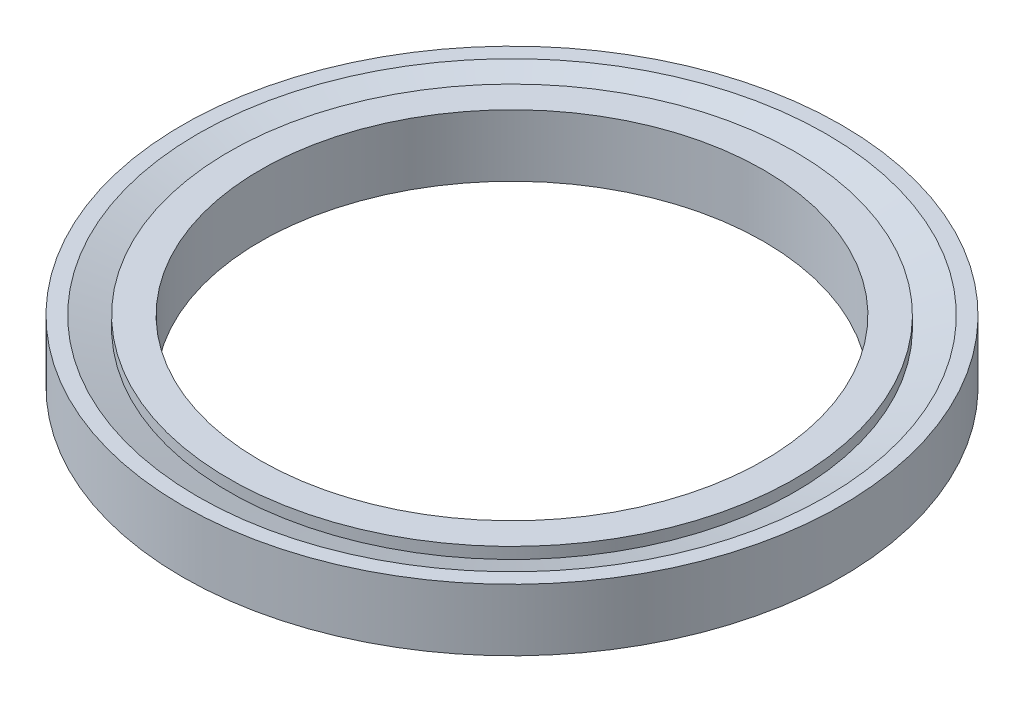
ISO-10303-21;
HEADER;
FILE_DESCRIPTION(('STEP AP214'),'2;1');
FILE_NAME('part.step','',(''),(''),'','','');
FILE_SCHEMA(('AUTOMOTIVE_DESIGN { 1 0 10303 214 1 1 1 1 }'));
ENDSEC;
DATA;
#1=APPLICATION_CONTEXT('core data for automotive mechanical design processes');
#2=APPLICATION_PROTOCOL_DEFINITION('international standard','automotive_design',2000,#1);
#3=PRODUCT_CONTEXT('',#1,'mechanical');
#4=PRODUCT('Part','Part','',(#3));
#5=PRODUCT_RELATED_PRODUCT_CATEGORY('part','',(#4));
#6=PRODUCT_DEFINITION_FORMATION('','',#4);
#7=PRODUCT_DEFINITION_CONTEXT('part definition',#1,'design');
#8=PRODUCT_DEFINITION('design','',#6,#7);
#9=PRODUCT_DEFINITION_SHAPE('','',#8);
#10=(LENGTH_UNIT() NAMED_UNIT(*) SI_UNIT(.MILLI.,.METRE.));
#11=(NAMED_UNIT(*) PLANE_ANGLE_UNIT() SI_UNIT($,.RADIAN.));
#12=(NAMED_UNIT(*) SI_UNIT($,.STERADIAN.) SOLID_ANGLE_UNIT());
#13=UNCERTAINTY_MEASURE_WITH_UNIT(LENGTH_MEASURE(1.E-05),#10,'distance_accuracy_value','');
#14=(GEOMETRIC_REPRESENTATION_CONTEXT(3) GLOBAL_UNCERTAINTY_ASSIGNED_CONTEXT((#13)) GLOBAL_UNIT_ASSIGNED_CONTEXT((#10,
#11,#12)) REPRESENTATION_CONTEXT('',''));
#15=CARTESIAN_POINT('',(0.,0.,0.));
#16=DIRECTION('',(0.,0.,1.));
#17=DIRECTION('',(1.,0.,0.));
#18=AXIS2_PLACEMENT_3D('',#15,#16,#17);
#19=CARTESIAN_POINT('',(0.,-0.999998,0.));
#20=DIRECTION('',(0.,1.,0.));
#21=DIRECTION('',(0.,0.,1.));
#22=AXIS2_PLACEMENT_3D('',#19,#20,#21);
#23=PLANE('',#22);
#24=CARTESIAN_POINT('',(0.,-0.999998,0.));
#25=DIRECTION('',(0.,1.,0.));
#26=DIRECTION('',(0.,0.,1.));
#27=AXIS2_PLACEMENT_3D('',#24,#25,#26);
#28=CIRCLE('',#27,10.6426);
#29=CARTESIAN_POINT('',(0.,-0.999998,10.6426));
#30=VERTEX_POINT('',#29);
#31=EDGE_CURVE('E10',#30,#30,#28,.T.);
#32=ORIENTED_EDGE('',*,*,#31,.F.);
#33=EDGE_LOOP('',(#32));
#34=FACE_BOUND('',#33,.T.);
#35=CARTESIAN_POINT('',(0.,-0.999998,0.));
#36=DIRECTION('',(0.,1.,0.));
#37=DIRECTION('',(0.,0.,1.));
#38=AXIS2_PLACEMENT_3D('',#35,#36,#37);
#39=CIRCLE('',#38,10.1468237631459);
#40=CARTESIAN_POINT('',(0.,-0.999998,10.1468237631459));
#41=VERTEX_POINT('',#40);
#42=EDGE_CURVE('E57',#41,#41,#39,.F.);
#43=ORIENTED_EDGE('',*,*,#42,.F.);
#44=EDGE_LOOP('',(#43));
#45=FACE_BOUND('',#44,.T.);
#46=ADVANCED_FACE('F35',(#34,#45),#23,.F.);
#47=CARTESIAN_POINT('',(0.,0.999998,0.));
#48=DIRECTION('',(0.,-1.,0.));
#49=DIRECTION('',(0.,0.,-1.));
#50=AXIS2_PLACEMENT_3D('',#47,#48,#49);
#51=PLANE('',#50);
#52=CARTESIAN_POINT('',(0.,0.999998,0.));
#53=DIRECTION('',(0.,1.,0.));
#54=DIRECTION('',(0.,0.,1.));
#55=AXIS2_PLACEMENT_3D('',#52,#53,#54);
#56=CIRCLE('',#55,10.6426);
#57=CARTESIAN_POINT('',(0.,0.999998,10.6426));
#58=VERTEX_POINT('',#57);
#59=EDGE_CURVE('E43',#58,#58,#56,.T.);
#60=ORIENTED_EDGE('',*,*,#59,.T.);
#61=EDGE_LOOP('',(#60));
#62=FACE_BOUND('',#61,.T.);
#63=CARTESIAN_POINT('',(0.,0.999998,0.));
#64=DIRECTION('',(0.,-1.,0.));
#65=DIRECTION('',(0.,0.,-1.));
#66=AXIS2_PLACEMENT_3D('',#63,#64,#65);
#67=CIRCLE('',#66,10.1468237631459);
#68=CARTESIAN_POINT('',(0.,0.999998,-10.1468237631459));
#69=VERTEX_POINT('',#68);
#70=EDGE_CURVE('E48',#69,#69,#67,.F.);
#71=ORIENTED_EDGE('',*,*,#70,.F.);
#72=EDGE_LOOP('',(#71));
#73=FACE_BOUND('',#72,.T.);
#74=ADVANCED_FACE('F89',(#62,#73),#51,.F.);
#75=CARTESIAN_POINT('',(0.,0.999998,0.));
#76=DIRECTION('',(0.,1.,0.));
#77=DIRECTION('',(0.,0.,1.));
#78=AXIS2_PLACEMENT_3D('',#75,#76,#77);
#79=CYLINDRICAL_SURFACE('',#78,10.6426);
#80=ORIENTED_EDGE('',*,*,#59,.F.);
#81=EDGE_LOOP('',(#80));
#82=FACE_BOUND('',#81,.T.);
#83=ORIENTED_EDGE('',*,*,#31,.T.);
#84=EDGE_LOOP('',(#83));
#85=FACE_BOUND('',#84,.T.);
#86=ADVANCED_FACE('F98',(#82,#85),#79,.T.);
#87=CARTESIAN_POINT('',(0.,1.21742516887287,0.));
#88=DIRECTION('',(0.,1.,0.));
#89=DIRECTION('',(0.,0.,1.));
#90=AXIS2_PLACEMENT_3D('',#87,#88,#89);
#91=CONICAL_SURFACE('',#90,10.7442,1.22173047639597);
#92=CARTESIAN_POINT('',(0.,0.635,0.));
#93=DIRECTION('',(0.,-1.,0.));
#94=DIRECTION('',(0.,0.,-1.));
#95=AXIS2_PLACEMENT_3D('',#92,#93,#94);
#96=CIRCLE('',#95,9.14400000000004);
#97=CARTESIAN_POINT('',(0.,0.635,-9.14400000000004));
#98=VERTEX_POINT('',#97);
#99=EDGE_CURVE('E55',#98,#98,#96,.T.);
#100=ORIENTED_EDGE('',*,*,#99,.T.);
#101=EDGE_LOOP('',(#100));
#102=FACE_BOUND('',#101,.T.);
#103=ORIENTED_EDGE('',*,*,#70,.T.);
#104=EDGE_LOOP('',(#103));
#105=FACE_BOUND('',#104,.T.);
#106=ADVANCED_FACE('F75',(#102,#105),#91,.F.);
#107=CARTESIAN_POINT('',(0.,0.,0.));
#108=DIRECTION('',(0.,-1.,0.));
#109=DIRECTION('',(0.,0.,-1.));
#110=AXIS2_PLACEMENT_3D('',#107,#108,#109);
#111=CYLINDRICAL_SURFACE('',#110,9.14400000000002);
#112=ORIENTED_EDGE('',*,*,#99,.F.);
#113=EDGE_LOOP('',(#112));
#114=FACE_BOUND('',#113,.T.);
#115=CARTESIAN_POINT('',(0.,0.999998,0.));
#116=DIRECTION('',(0.,-1.,0.));
#117=DIRECTION('',(0.,0.,-1.));
#118=AXIS2_PLACEMENT_3D('',#115,#116,#117);
#119=CIRCLE('',#118,9.14400000000002);
#120=CARTESIAN_POINT('',(0.,0.999998,-9.14400000000002));
#121=VERTEX_POINT('',#120);
#122=EDGE_CURVE('E52',#121,#121,#119,.T.);
#123=ORIENTED_EDGE('',*,*,#122,.T.);
#124=EDGE_LOOP('',(#123));
#125=FACE_BOUND('',#124,.T.);
#126=ADVANCED_FACE('F78',(#114,#125),#111,.T.);
#127=CARTESIAN_POINT('',(0.,0.999998,0.));
#128=DIRECTION('',(0.,1.,0.));
#129=DIRECTION('',(0.,0.,1.));
#130=AXIS2_PLACEMENT_3D('',#127,#128,#129);
#131=CIRCLE('',#130,8.128);
#132=CARTESIAN_POINT('',(0.,0.999998,8.128));
#133=VERTEX_POINT('',#132);
#134=EDGE_CURVE('E69',#133,#133,#131,.T.);
#135=ORIENTED_EDGE('',*,*,#134,.F.);
#136=EDGE_LOOP('',(#135));
#137=FACE_BOUND('',#136,.T.);
#138=ORIENTED_EDGE('',*,*,#122,.F.);
#139=EDGE_LOOP('',(#138));
#140=FACE_BOUND('',#139,.T.);
#141=ADVANCED_FACE('F81',(#137,#140),#51,.F.);
#142=CARTESIAN_POINT('',(0.,0.,0.));
#143=DIRECTION('',(0.,-1.,0.));
#144=DIRECTION('',(0.,0.,-1.));
#145=AXIS2_PLACEMENT_3D('',#142,#143,#144);
#146=CYLINDRICAL_SURFACE('',#145,9.14400000000002);
#147=CARTESIAN_POINT('',(0.,-0.635000000000002,0.));
#148=DIRECTION('',(0.,-1.,0.));
#149=DIRECTION('',(0.,0.,-1.));
#150=AXIS2_PLACEMENT_3D('',#147,#148,#149);
#151=CIRCLE('',#150,9.14400000000004);
#152=CARTESIAN_POINT('',(0.,-0.635000000000002,-9.14400000000004));
#153=VERTEX_POINT('',#152);
#154=EDGE_CURVE('E59',#153,#153,#151,.T.);
#155=ORIENTED_EDGE('',*,*,#154,.T.);
#156=EDGE_LOOP('',(#155));
#157=FACE_BOUND('',#156,.T.);
#158=CARTESIAN_POINT('',(0.,-0.999998,0.));
#159=DIRECTION('',(0.,1.,0.));
#160=DIRECTION('',(0.,0.,1.));
#161=AXIS2_PLACEMENT_3D('',#158,#159,#160);
#162=CIRCLE('',#161,9.14400000000002);
#163=CARTESIAN_POINT('',(0.,-0.999998,9.14400000000002));
#164=VERTEX_POINT('',#163);
#165=EDGE_CURVE('E39',#164,#164,#162,.T.);
#166=ORIENTED_EDGE('',*,*,#165,.T.);
#167=EDGE_LOOP('',(#166));
#168=FACE_BOUND('',#167,.T.);
#169=ADVANCED_FACE('F86',(#157,#168),#146,.T.);
#170=CARTESIAN_POINT('',(0.,-0.635000000000002,0.));
#171=DIRECTION('',(0.,-1.,0.));
#172=DIRECTION('',(0.,0.,-1.));
#173=AXIS2_PLACEMENT_3D('',#170,#171,#172);
#174=CONICAL_SURFACE('',#173,9.14400000000004,1.22173047639597);
#175=ORIENTED_EDGE('',*,*,#154,.F.);
#176=EDGE_LOOP('',(#175));
#177=FACE_BOUND('',#176,.T.);
#178=ORIENTED_EDGE('',*,*,#42,.T.);
#179=EDGE_LOOP('',(#178));
#180=FACE_BOUND('',#179,.T.);
#181=ADVANCED_FACE('F93',(#177,#180),#174,.F.);
#182=CARTESIAN_POINT('',(0.,-0.999998,0.));
#183=DIRECTION('',(0.,1.,0.));
#184=DIRECTION('',(0.,0.,1.));
#185=AXIS2_PLACEMENT_3D('',#182,#183,#184);
#186=CIRCLE('',#185,8.128);
#187=CARTESIAN_POINT('',(0.,-0.999998,8.128));
#188=VERTEX_POINT('',#187);
#189=EDGE_CURVE('E64',#188,#188,#186,.T.);
#190=ORIENTED_EDGE('',*,*,#189,.T.);
#191=EDGE_LOOP('',(#190));
#192=FACE_BOUND('',#191,.T.);
#193=ORIENTED_EDGE('',*,*,#165,.F.);
#194=EDGE_LOOP('',(#193));
#195=FACE_BOUND('',#194,.T.);
#196=ADVANCED_FACE('F37',(#192,#195),#23,.F.);
#197=CARTESIAN_POINT('',(0.,-0.999998,0.));
#198=DIRECTION('',(0.,1.,0.));
#199=DIRECTION('',(0.,0.,1.));
#200=AXIS2_PLACEMENT_3D('',#197,#198,#199);
#201=CYLINDRICAL_SURFACE('',#200,8.128);
#202=ORIENTED_EDGE('',*,*,#189,.F.);
#203=EDGE_LOOP('',(#202));
#204=FACE_BOUND('',#203,.T.);
#205=ORIENTED_EDGE('',*,*,#134,.T.);
#206=EDGE_LOOP('',(#205));
#207=FACE_BOUND('',#206,.T.);
#208=ADVANCED_FACE('F106',(#204,#207),#201,.F.);
#209=CLOSED_SHELL('',(#46,#74,#86,#106,#126,#141,#169,#181,#196,#208));
#210=MANIFOLD_SOLID_BREP('B2',#209);
#211=ADVANCED_BREP_SHAPE_REPRESENTATION('',(#18,#210),#14);
#212=SHAPE_DEFINITION_REPRESENTATION(#9,#211);
ENDSEC;
END-ISO-10303-21;
